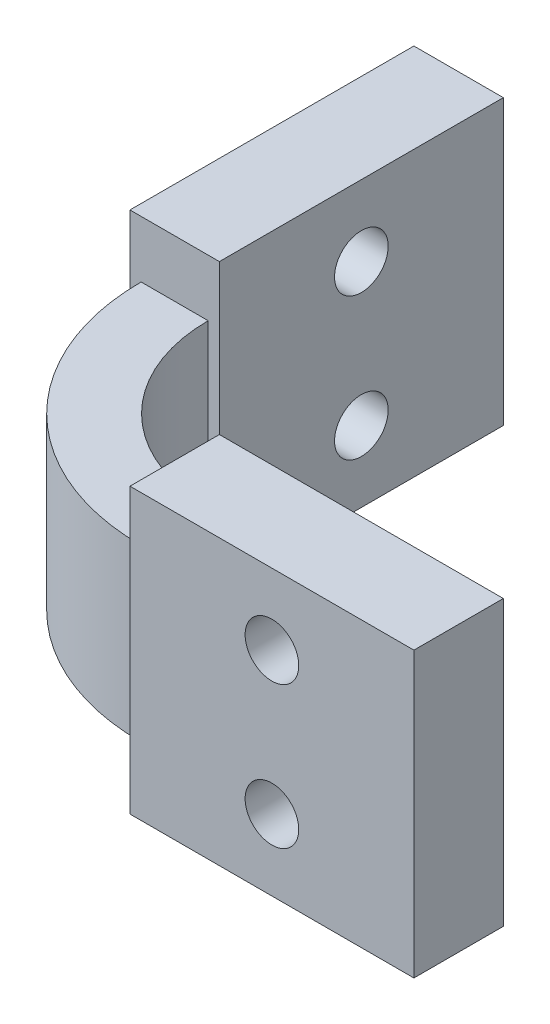
ISO-10303-21;
HEADER;
FILE_DESCRIPTION(('STEP AP214'),'2;1');
FILE_NAME('part.step','',(''),(''),'','','');
FILE_SCHEMA(('AUTOMOTIVE_DESIGN { 1 0 10303 214 1 1 1 1 }'));
ENDSEC;
DATA;
#1=APPLICATION_CONTEXT('core data for automotive mechanical design processes');
#2=APPLICATION_PROTOCOL_DEFINITION('international standard','automotive_design',2000,#1);
#3=PRODUCT_CONTEXT('',#1,'mechanical');
#4=PRODUCT('Part','Part','',(#3));
#5=PRODUCT_RELATED_PRODUCT_CATEGORY('part','',(#4));
#6=PRODUCT_DEFINITION_FORMATION('','',#4);
#7=PRODUCT_DEFINITION_CONTEXT('part definition',#1,'design');
#8=PRODUCT_DEFINITION('design','',#6,#7);
#9=PRODUCT_DEFINITION_SHAPE('','',#8);
#10=(LENGTH_UNIT() NAMED_UNIT(*) SI_UNIT(.MILLI.,.METRE.));
#11=(NAMED_UNIT(*) PLANE_ANGLE_UNIT() SI_UNIT($,.RADIAN.));
#12=(NAMED_UNIT(*) SI_UNIT($,.STERADIAN.) SOLID_ANGLE_UNIT());
#13=UNCERTAINTY_MEASURE_WITH_UNIT(LENGTH_MEASURE(1.E-05),#10,'distance_accuracy_value','');
#14=(GEOMETRIC_REPRESENTATION_CONTEXT(3) GLOBAL_UNCERTAINTY_ASSIGNED_CONTEXT((#13)) GLOBAL_UNIT_ASSIGNED_CONTEXT((#10,
#11,#12)) REPRESENTATION_CONTEXT('',''));
#15=CARTESIAN_POINT('',(0.,0.,0.));
#16=DIRECTION('',(0.,0.,1.));
#17=DIRECTION('',(1.,0.,0.));
#18=AXIS2_PLACEMENT_3D('',#15,#16,#17);
#19=CARTESIAN_POINT('',(6.95399999999999,3.81,-8.16));
#20=DIRECTION('',(0.,1.,0.));
#21=DIRECTION('',(0.,0.,1.));
#22=AXIS2_PLACEMENT_3D('',#19,#20,#21);
#23=PLANE('',#22);
#24=CARTESIAN_POINT('',(6.954,3.81,-8.16));
#25=DIRECTION('',(0.,-1.,0.));
#26=DIRECTION('',(0.,0.,1.));
#27=AXIS2_PLACEMENT_3D('',#24,#25,#26);
#28=CIRCLE('',#27,7.2);
#29=CARTESIAN_POINT('',(6.954,3.81,-0.960000000000003));
#30=VERTEX_POINT('',#29);
#31=CARTESIAN_POINT('',(-0.245999999999999,3.81,-8.16));
#32=VERTEX_POINT('',#31);
#33=EDGE_CURVE('E50',#30,#32,#28,.T.);
#34=ORIENTED_EDGE('',*,*,#33,.T.);
#35=DIRECTION('',(-1.,0.,0.));
#36=VECTOR('',#35,1.);
#37=CARTESIAN_POINT('',(6.95399999999999,3.81,-8.16));
#38=LINE('',#37,#36);
#39=CARTESIAN_POINT('',(-3.24600000000001,3.81,-8.16));
#40=VERTEX_POINT('',#39);
#41=EDGE_CURVE('E165',#32,#40,#38,.T.);
#42=ORIENTED_EDGE('',*,*,#41,.T.);
#43=CARTESIAN_POINT('',(6.95399999999999,3.81,-8.16));
#44=DIRECTION('',(0.,1.,0.));
#45=DIRECTION('',(0.,0.,1.));
#46=AXIS2_PLACEMENT_3D('',#43,#44,#45);
#47=CIRCLE('',#46,10.2);
#48=CARTESIAN_POINT('',(6.954,3.81,2.04));
#49=VERTEX_POINT('',#48);
#50=EDGE_CURVE('E189',#40,#49,#47,.T.);
#51=ORIENTED_EDGE('',*,*,#50,.T.);
#52=DIRECTION('',(0.,0.,1.));
#53=VECTOR('',#52,1.);
#54=CARTESIAN_POINT('',(6.954,3.81,-1.46));
#55=LINE('',#54,#53);
#56=EDGE_CURVE('E55',#30,#49,#55,.T.);
#57=ORIENTED_EDGE('',*,*,#56,.F.);
#58=EDGE_LOOP('',(#34,#42,#51,#57));
#59=FACE_BOUND('',#58,.T.);
#60=ADVANCED_FACE('F35',(#59),#23,.T.);
#61=CARTESIAN_POINT('',(-3.746,3.81,-20.86));
#62=DIRECTION('',(1.,0.,0.));
#63=DIRECTION('',(0.,0.,-1.));
#64=AXIS2_PLACEMENT_3D('',#61,#62,#63);
#65=PLANE('',#64);
#66=CARTESIAN_POINT('',(-3.746,3.175,-14.51));
#67=DIRECTION('',(1.,0.,0.));
#68=DIRECTION('',(0.,0.,-1.));
#69=AXIS2_PLACEMENT_3D('',#66,#67,#68);
#70=CIRCLE('',#69,1.2);
#71=CARTESIAN_POINT('',(-3.746,3.175,-15.71));
#72=VERTEX_POINT('',#71);
#73=EDGE_CURVE('E303',#72,#72,#70,.T.);
#74=ORIENTED_EDGE('',*,*,#73,.T.);
#75=EDGE_LOOP('',(#74));
#76=FACE_BOUND('',#75,.T.);
#77=CARTESIAN_POINT('',(-3.746,-3.175,-14.51));
#78=DIRECTION('',(1.,0.,0.));
#79=DIRECTION('',(0.,0.,-1.));
#80=AXIS2_PLACEMENT_3D('',#77,#78,#79);
#81=CIRCLE('',#80,1.2);
#82=CARTESIAN_POINT('',(-3.746,-3.175,-15.71));
#83=VERTEX_POINT('',#82);
#84=EDGE_CURVE('E143',#83,#83,#81,.T.);
#85=ORIENTED_EDGE('',*,*,#84,.T.);
#86=EDGE_LOOP('',(#85));
#87=FACE_BOUND('',#86,.T.);
#88=DIRECTION('',(0.,-1.,0.));
#89=VECTOR('',#88,1.);
#90=CARTESIAN_POINT('',(-3.746,3.81,-20.86));
#91=LINE('',#90,#89);
#92=CARTESIAN_POINT('',(-3.746,6.35,-20.86));
#93=VERTEX_POINT('',#92);
#94=CARTESIAN_POINT('',(-3.746,-6.35,-20.86));
#95=VERTEX_POINT('',#94);
#96=EDGE_CURVE('E145',#93,#95,#91,.T.);
#97=ORIENTED_EDGE('',*,*,#96,.T.);
#98=DIRECTION('',(0.,0.,1.));
#99=VECTOR('',#98,1.);
#100=CARTESIAN_POINT('',(-3.746,-6.35,-20.86));
#101=LINE('',#100,#99);
#102=CARTESIAN_POINT('',(-3.746,-6.35,-8.16));
#103=VERTEX_POINT('',#102);
#104=EDGE_CURVE('E139',#95,#103,#101,.T.);
#105=ORIENTED_EDGE('',*,*,#104,.T.);
#106=DIRECTION('',(0.,-1.,0.));
#107=VECTOR('',#106,1.);
#108=CARTESIAN_POINT('',(-3.746,3.81,-8.16));
#109=LINE('',#108,#107);
#110=CARTESIAN_POINT('',(-3.746,6.35,-8.16));
#111=VERTEX_POINT('',#110);
#112=EDGE_CURVE('E122',#111,#103,#109,.T.);
#113=ORIENTED_EDGE('',*,*,#112,.F.);
#114=DIRECTION('',(0.,0.,1.));
#115=VECTOR('',#114,1.);
#116=CARTESIAN_POINT('',(-3.746,6.35,-20.86));
#117=LINE('',#116,#115);
#118=EDGE_CURVE('E173',#93,#111,#117,.T.);
#119=ORIENTED_EDGE('',*,*,#118,.F.);
#120=EDGE_LOOP('',(#97,#105,#113,#119));
#121=FACE_BOUND('',#120,.T.);
#122=ADVANCED_FACE('F37',(#76,#87,#121),#65,.F.);
#123=CARTESIAN_POINT('',(6.95399999999999,3.81,-8.16));
#124=DIRECTION('',(0.,-1.,0.));
#125=DIRECTION('',(0.,0.,-1.));
#126=AXIS2_PLACEMENT_3D('',#123,#124,#125);
#127=CYLINDRICAL_SURFACE('',#126,10.2);
#128=CARTESIAN_POINT('',(6.95399999999999,-3.81,-8.16));
#129=DIRECTION('',(0.,1.,0.));
#130=DIRECTION('',(0.,0.,1.));
#131=AXIS2_PLACEMENT_3D('',#128,#129,#130);
#132=CIRCLE('',#131,10.2);
#133=CARTESIAN_POINT('',(-3.24600000000001,-3.81,-8.16));
#134=VERTEX_POINT('',#133);
#135=CARTESIAN_POINT('',(6.954,-3.81,2.04));
#136=VERTEX_POINT('',#135);
#137=EDGE_CURVE('E187',#134,#136,#132,.T.);
#138=ORIENTED_EDGE('',*,*,#137,.T.);
#139=DIRECTION('',(0.,-1.,0.));
#140=VECTOR('',#139,1.);
#141=CARTESIAN_POINT('',(6.954,3.81,2.04));
#142=LINE('',#141,#140);
#143=EDGE_CURVE('E216',#49,#136,#142,.T.);
#144=ORIENTED_EDGE('',*,*,#143,.F.);
#145=ORIENTED_EDGE('',*,*,#50,.F.);
#146=DIRECTION('',(0.,-1.,0.));
#147=VECTOR('',#146,1.);
#148=CARTESIAN_POINT('',(-3.24600000000001,3.81,-8.16));
#149=LINE('',#148,#147);
#150=EDGE_CURVE('E133',#40,#134,#149,.T.);
#151=ORIENTED_EDGE('',*,*,#150,.T.);
#152=EDGE_LOOP('',(#138,#144,#145,#151));
#153=FACE_BOUND('',#152,.T.);
#154=ADVANCED_FACE('F227',(#153),#127,.T.);
#155=CARTESIAN_POINT('',(6.954,3.81,2.54));
#156=DIRECTION('',(0.,0.,-1.));
#157=DIRECTION('',(-1.,0.,0.));
#158=AXIS2_PLACEMENT_3D('',#155,#156,#157);
#159=PLANE('',#158);
#160=CARTESIAN_POINT('',(13.304,3.175,2.54));
#161=DIRECTION('',(0.,0.,-1.));
#162=DIRECTION('',(-1.,0.,0.));
#163=AXIS2_PLACEMENT_3D('',#160,#161,#162);
#164=CIRCLE('',#163,1.19999999999999);
#165=CARTESIAN_POINT('',(12.104,3.175,2.54));
#166=VERTEX_POINT('',#165);
#167=EDGE_CURVE('E286',#166,#166,#164,.T.);
#168=ORIENTED_EDGE('',*,*,#167,.T.);
#169=EDGE_LOOP('',(#168));
#170=FACE_BOUND('',#169,.T.);
#171=CARTESIAN_POINT('',(13.304,-3.175,2.54));
#172=DIRECTION('',(0.,0.,-1.));
#173=DIRECTION('',(-1.,0.,0.));
#174=AXIS2_PLACEMENT_3D('',#171,#172,#173);
#175=CIRCLE('',#174,1.19999999999999);
#176=CARTESIAN_POINT('',(12.104,-3.175,2.54));
#177=VERTEX_POINT('',#176);
#178=EDGE_CURVE('E297',#177,#177,#175,.T.);
#179=ORIENTED_EDGE('',*,*,#178,.T.);
#180=EDGE_LOOP('',(#179));
#181=FACE_BOUND('',#180,.T.);
#182=DIRECTION('',(0.,-1.,0.));
#183=VECTOR('',#182,1.);
#184=CARTESIAN_POINT('',(6.954,3.81,2.54));
#185=LINE('',#184,#183);
#186=CARTESIAN_POINT('',(6.954,6.35,2.54));
#187=VERTEX_POINT('',#186);
#188=CARTESIAN_POINT('',(6.954,-6.35,2.54));
#189=VERTEX_POINT('',#188);
#190=EDGE_CURVE('E214',#187,#189,#185,.T.);
#191=ORIENTED_EDGE('',*,*,#190,.T.);
#192=DIRECTION('',(1.,0.,0.));
#193=VECTOR('',#192,1.);
#194=CARTESIAN_POINT('',(6.954,-6.35,2.54));
#195=LINE('',#194,#193);
#196=CARTESIAN_POINT('',(19.654,-6.35,2.54));
#197=VERTEX_POINT('',#196);
#198=EDGE_CURVE('E161',#189,#197,#195,.T.);
#199=ORIENTED_EDGE('',*,*,#198,.T.);
#200=DIRECTION('',(0.,-1.,0.));
#201=VECTOR('',#200,1.);
#202=CARTESIAN_POINT('',(19.654,3.81,2.54));
#203=LINE('',#202,#201);
#204=CARTESIAN_POINT('',(19.654,6.35,2.54));
#205=VERTEX_POINT('',#204);
#206=EDGE_CURVE('E212',#205,#197,#203,.T.);
#207=ORIENTED_EDGE('',*,*,#206,.F.);
#208=DIRECTION('',(1.,0.,0.));
#209=VECTOR('',#208,1.);
#210=CARTESIAN_POINT('',(6.954,6.35,2.54));
#211=LINE('',#210,#209);
#212=EDGE_CURVE('E178',#187,#205,#211,.T.);
#213=ORIENTED_EDGE('',*,*,#212,.F.);
#214=EDGE_LOOP('',(#191,#199,#207,#213));
#215=FACE_BOUND('',#214,.T.);
#216=ADVANCED_FACE('F336',(#170,#181,#215),#159,.F.);
#217=CARTESIAN_POINT('',(19.654,3.81,-1.46));
#218=DIRECTION('',(-1.,0.,0.));
#219=DIRECTION('',(0.,0.,1.));
#220=AXIS2_PLACEMENT_3D('',#217,#218,#219);
#221=PLANE('',#220);
#222=ORIENTED_EDGE('',*,*,#206,.T.);
#223=DIRECTION('',(0.,0.,-1.));
#224=VECTOR('',#223,1.);
#225=CARTESIAN_POINT('',(19.654,-6.35,2.54));
#226=LINE('',#225,#224);
#227=CARTESIAN_POINT('',(19.654,-6.35,-1.46));
#228=VERTEX_POINT('',#227);
#229=EDGE_CURVE('E158',#197,#228,#226,.T.);
#230=ORIENTED_EDGE('',*,*,#229,.T.);
#231=DIRECTION('',(0.,-1.,0.));
#232=VECTOR('',#231,1.);
#233=CARTESIAN_POINT('',(19.654,3.81,-1.46));
#234=LINE('',#233,#232);
#235=CARTESIAN_POINT('',(19.654,6.35,-1.46));
#236=VERTEX_POINT('',#235);
#237=EDGE_CURVE('E210',#236,#228,#234,.T.);
#238=ORIENTED_EDGE('',*,*,#237,.F.);
#239=DIRECTION('',(0.,0.,-1.));
#240=VECTOR('',#239,1.);
#241=CARTESIAN_POINT('',(19.654,6.35,2.54));
#242=LINE('',#241,#240);
#243=EDGE_CURVE('E181',#205,#236,#242,.T.);
#244=ORIENTED_EDGE('',*,*,#243,.F.);
#245=EDGE_LOOP('',(#222,#230,#238,#244));
#246=FACE_BOUND('',#245,.T.);
#247=ADVANCED_FACE('F333',(#246),#221,.F.);
#248=CARTESIAN_POINT('',(6.954,3.81,-1.46));
#249=DIRECTION('',(0.,0.,1.));
#250=DIRECTION('',(1.,0.,0.));
#251=AXIS2_PLACEMENT_3D('',#248,#249,#250);
#252=PLANE('',#251);
#253=CARTESIAN_POINT('',(13.304,3.175,-1.46));
#254=DIRECTION('',(0.,0.,-1.));
#255=DIRECTION('',(-1.,0.,0.));
#256=AXIS2_PLACEMENT_3D('',#253,#254,#255);
#257=CIRCLE('',#256,1.19999999999999);
#258=CARTESIAN_POINT('',(12.104,3.175,-1.46));
#259=VERTEX_POINT('',#258);
#260=EDGE_CURVE('E289',#259,#259,#257,.T.);
#261=ORIENTED_EDGE('',*,*,#260,.F.);
#262=EDGE_LOOP('',(#261));
#263=FACE_BOUND('',#262,.T.);
#264=CARTESIAN_POINT('',(13.304,-3.175,-1.46));
#265=DIRECTION('',(0.,0.,-1.));
#266=DIRECTION('',(-1.,0.,0.));
#267=AXIS2_PLACEMENT_3D('',#264,#265,#266);
#268=CIRCLE('',#267,1.19999999999999);
#269=CARTESIAN_POINT('',(12.104,-3.175,-1.46));
#270=VERTEX_POINT('',#269);
#271=EDGE_CURVE('E292',#270,#270,#268,.T.);
#272=ORIENTED_EDGE('',*,*,#271,.F.);
#273=EDGE_LOOP('',(#272));
#274=FACE_BOUND('',#273,.T.);
#275=ORIENTED_EDGE('',*,*,#237,.T.);
#276=DIRECTION('',(-1.,0.,0.));
#277=VECTOR('',#276,1.);
#278=CARTESIAN_POINT('',(19.654,-6.35,-1.46));
#279=LINE('',#278,#277);
#280=CARTESIAN_POINT('',(6.954,-6.35,-1.46));
#281=VERTEX_POINT('',#280);
#282=EDGE_CURVE('E155',#228,#281,#279,.T.);
#283=ORIENTED_EDGE('',*,*,#282,.T.);
#284=DIRECTION('',(0.,-1.,0.));
#285=VECTOR('',#284,1.);
#286=CARTESIAN_POINT('',(6.954,3.81,-1.46));
#287=LINE('',#286,#285);
#288=CARTESIAN_POINT('',(6.954,6.35,-1.46));
#289=VERTEX_POINT('',#288);
#290=EDGE_CURVE('E208',#289,#281,#287,.T.);
#291=ORIENTED_EDGE('',*,*,#290,.F.);
#292=DIRECTION('',(-1.,0.,0.));
#293=VECTOR('',#292,1.);
#294=CARTESIAN_POINT('',(19.654,6.35,-1.46));
#295=LINE('',#294,#293);
#296=EDGE_CURVE('E184',#236,#289,#295,.T.);
#297=ORIENTED_EDGE('',*,*,#296,.F.);
#298=EDGE_LOOP('',(#275,#283,#291,#297));
#299=FACE_BOUND('',#298,.T.);
#300=ADVANCED_FACE('F330',(#263,#274,#299),#252,.F.);
#301=CARTESIAN_POINT('',(6.954,3.81,-1.46));
#302=DIRECTION('',(1.,0.,0.));
#303=DIRECTION('',(0.,0.,-1.));
#304=AXIS2_PLACEMENT_3D('',#301,#302,#303);
#305=PLANE('',#304);
#306=DIRECTION('',(0.,0.,1.));
#307=VECTOR('',#306,1.);
#308=CARTESIAN_POINT('',(6.954,-3.81,-1.46));
#309=LINE('',#308,#307);
#310=CARTESIAN_POINT('',(6.954,-3.81,-0.960000000000003));
#311=VERTEX_POINT('',#310);
#312=EDGE_CURVE('E43',#311,#136,#309,.T.);
#313=ORIENTED_EDGE('',*,*,#312,.F.);
#314=DIRECTION('',(0.,-1.,0.));
#315=VECTOR('',#314,1.);
#316=CARTESIAN_POINT('',(6.954,3.81,-0.960000000000003));
#317=LINE('',#316,#315);
#318=EDGE_CURVE('E205',#30,#311,#317,.T.);
#319=ORIENTED_EDGE('',*,*,#318,.F.);
#320=ORIENTED_EDGE('',*,*,#56,.T.);
#321=ORIENTED_EDGE('',*,*,#143,.T.);
#322=EDGE_LOOP('',(#313,#319,#320,#321));
#323=FACE_BOUND('',#322,.T.);
#324=ORIENTED_EDGE('',*,*,#290,.T.);
#325=DIRECTION('',(0.,0.,1.));
#326=VECTOR('',#325,1.);
#327=CARTESIAN_POINT('',(6.954,-6.35,-1.46));
#328=LINE('',#327,#326);
#329=EDGE_CURVE('E152',#281,#189,#328,.T.);
#330=ORIENTED_EDGE('',*,*,#329,.T.);
#331=ORIENTED_EDGE('',*,*,#190,.F.);
#332=DIRECTION('',(0.,0.,1.));
#333=VECTOR('',#332,1.);
#334=CARTESIAN_POINT('',(6.954,6.35,-1.46));
#335=LINE('',#334,#333);
#336=EDGE_CURVE('E175',#289,#187,#335,.T.);
#337=ORIENTED_EDGE('',*,*,#336,.F.);
#338=EDGE_LOOP('',(#324,#330,#331,#337));
#339=FACE_BOUND('',#338,.T.);
#340=ADVANCED_FACE('F229',(#323,#339),#305,.F.);
#341=CARTESIAN_POINT('',(6.954,3.81,-8.16));
#342=DIRECTION('',(0.,-1.,0.));
#343=DIRECTION('',(0.,0.,-1.));
#344=AXIS2_PLACEMENT_3D('',#341,#342,#343);
#345=CYLINDRICAL_SURFACE('',#344,7.2);
#346=CARTESIAN_POINT('',(6.954,-3.81,-8.16));
#347=DIRECTION('',(0.,-1.,0.));
#348=DIRECTION('',(0.,0.,1.));
#349=AXIS2_PLACEMENT_3D('',#346,#347,#348);
#350=CIRCLE('',#349,7.2);
#351=CARTESIAN_POINT('',(-0.245999999999998,-3.81,-8.16));
#352=VERTEX_POINT('',#351);
#353=EDGE_CURVE('E191',#311,#352,#350,.T.);
#354=ORIENTED_EDGE('',*,*,#353,.T.);
#355=DIRECTION('',(0.,-1.,0.));
#356=VECTOR('',#355,1.);
#357=CARTESIAN_POINT('',(-0.245999999999999,3.81,-8.16));
#358=LINE('',#357,#356);
#359=EDGE_CURVE('E202',#32,#352,#358,.T.);
#360=ORIENTED_EDGE('',*,*,#359,.F.);
#361=ORIENTED_EDGE('',*,*,#33,.F.);
#362=ORIENTED_EDGE('',*,*,#318,.T.);
#363=EDGE_LOOP('',(#354,#360,#361,#362));
#364=FACE_BOUND('',#363,.T.);
#365=ADVANCED_FACE('F233',(#364),#345,.F.);
#366=CARTESIAN_POINT('',(-0.245999999999999,3.81,-8.16));
#367=DIRECTION('',(0.,0.,-1.));
#368=DIRECTION('',(-1.,0.,0.));
#369=AXIS2_PLACEMENT_3D('',#366,#367,#368);
#370=PLANE('',#369);
#371=DIRECTION('',(1.,0.,0.));
#372=VECTOR('',#371,1.);
#373=CARTESIAN_POINT('',(6.95399999999999,-3.81,-8.16));
#374=LINE('',#373,#372);
#375=EDGE_CURVE('E11',#134,#352,#374,.T.);
#376=ORIENTED_EDGE('',*,*,#375,.F.);
#377=ORIENTED_EDGE('',*,*,#150,.F.);
#378=ORIENTED_EDGE('',*,*,#41,.F.);
#379=ORIENTED_EDGE('',*,*,#359,.T.);
#380=EDGE_LOOP('',(#376,#377,#378,#379));
#381=FACE_BOUND('',#380,.T.);
#382=ORIENTED_EDGE('',*,*,#112,.T.);
#383=DIRECTION('',(1.,0.,0.));
#384=VECTOR('',#383,1.);
#385=CARTESIAN_POINT('',(-3.746,-6.35,-8.16));
#386=LINE('',#385,#384);
#387=CARTESIAN_POINT('',(0.253999999999996,-6.35,-8.16));
#388=VERTEX_POINT('',#387);
#389=EDGE_CURVE('E125',#103,#388,#386,.T.);
#390=ORIENTED_EDGE('',*,*,#389,.T.);
#391=DIRECTION('',(0.,-1.,0.));
#392=VECTOR('',#391,1.);
#393=CARTESIAN_POINT('',(0.253999999999996,3.81,-8.16));
#394=LINE('',#393,#392);
#395=CARTESIAN_POINT('',(0.253999999999996,6.35,-8.16));
#396=VERTEX_POINT('',#395);
#397=EDGE_CURVE('E200',#396,#388,#394,.T.);
#398=ORIENTED_EDGE('',*,*,#397,.F.);
#399=DIRECTION('',(1.,0.,0.));
#400=VECTOR('',#399,1.);
#401=CARTESIAN_POINT('',(-3.746,6.35,-8.16));
#402=LINE('',#401,#400);
#403=EDGE_CURVE('E128',#111,#396,#402,.T.);
#404=ORIENTED_EDGE('',*,*,#403,.F.);
#405=EDGE_LOOP('',(#382,#390,#398,#404));
#406=FACE_BOUND('',#405,.T.);
#407=ADVANCED_FACE('F124',(#381,#406),#370,.F.);
#408=CARTESIAN_POINT('',(0.253999999999997,3.81,-20.86));
#409=DIRECTION('',(-1.,0.,0.));
#410=DIRECTION('',(0.,0.,1.));
#411=AXIS2_PLACEMENT_3D('',#408,#409,#410);
#412=PLANE('',#411);
#413=CARTESIAN_POINT('',(0.253999999999998,3.175,-14.51));
#414=DIRECTION('',(1.,0.,0.));
#415=DIRECTION('',(0.,0.,-1.));
#416=AXIS2_PLACEMENT_3D('',#413,#414,#415);
#417=CIRCLE('',#416,1.19999999999999);
#418=CARTESIAN_POINT('',(0.253999999999998,3.175,-15.71));
#419=VERTEX_POINT('',#418);
#420=EDGE_CURVE('E300',#419,#419,#417,.T.);
#421=ORIENTED_EDGE('',*,*,#420,.F.);
#422=EDGE_LOOP('',(#421));
#423=FACE_BOUND('',#422,.T.);
#424=CARTESIAN_POINT('',(0.253999999999998,-3.175,-14.51));
#425=DIRECTION('',(1.,0.,0.));
#426=DIRECTION('',(0.,0.,-1.));
#427=AXIS2_PLACEMENT_3D('',#424,#425,#426);
#428=CIRCLE('',#427,1.19999999999999);
#429=CARTESIAN_POINT('',(0.253999999999998,-3.175,-15.71));
#430=VERTEX_POINT('',#429);
#431=EDGE_CURVE('E306',#430,#430,#428,.T.);
#432=ORIENTED_EDGE('',*,*,#431,.F.);
#433=EDGE_LOOP('',(#432));
#434=FACE_BOUND('',#433,.T.);
#435=ORIENTED_EDGE('',*,*,#397,.T.);
#436=DIRECTION('',(0.,0.,-1.));
#437=VECTOR('',#436,1.);
#438=CARTESIAN_POINT('',(0.253999999999996,-6.35,-8.16));
#439=LINE('',#438,#437);
#440=CARTESIAN_POINT('',(0.253999999999997,-6.35,-20.86));
#441=VERTEX_POINT('',#440);
#442=EDGE_CURVE('E142',#388,#441,#439,.T.);
#443=ORIENTED_EDGE('',*,*,#442,.T.);
#444=DIRECTION('',(0.,-1.,0.));
#445=VECTOR('',#444,1.);
#446=CARTESIAN_POINT('',(0.253999999999997,3.81,-20.86));
#447=LINE('',#446,#445);
#448=CARTESIAN_POINT('',(0.253999999999997,6.35,-20.86));
#449=VERTEX_POINT('',#448);
#450=EDGE_CURVE('E198',#449,#441,#447,.T.);
#451=ORIENTED_EDGE('',*,*,#450,.F.);
#452=DIRECTION('',(0.,0.,-1.));
#453=VECTOR('',#452,1.);
#454=CARTESIAN_POINT('',(0.253999999999996,6.35,-8.16));
#455=LINE('',#454,#453);
#456=EDGE_CURVE('E167',#396,#449,#455,.T.);
#457=ORIENTED_EDGE('',*,*,#456,.F.);
#458=EDGE_LOOP('',(#435,#443,#451,#457));
#459=FACE_BOUND('',#458,.T.);
#460=ADVANCED_FACE('F247',(#423,#434,#459),#412,.F.);
#461=CARTESIAN_POINT('',(-3.746,3.81,-20.86));
#462=DIRECTION('',(0.,0.,1.));
#463=DIRECTION('',(1.,0.,0.));
#464=AXIS2_PLACEMENT_3D('',#461,#462,#463);
#465=PLANE('',#464);
#466=ORIENTED_EDGE('',*,*,#450,.T.);
#467=DIRECTION('',(-1.,0.,0.));
#468=VECTOR('',#467,1.);
#469=CARTESIAN_POINT('',(0.253999999999997,-6.35,-20.86));
#470=LINE('',#469,#468);
#471=EDGE_CURVE('E146',#441,#95,#470,.T.);
#472=ORIENTED_EDGE('',*,*,#471,.T.);
#473=ORIENTED_EDGE('',*,*,#96,.F.);
#474=DIRECTION('',(-1.,0.,0.));
#475=VECTOR('',#474,1.);
#476=CARTESIAN_POINT('',(0.253999999999997,6.35,-20.86));
#477=LINE('',#476,#475);
#478=EDGE_CURVE('E170',#449,#93,#477,.T.);
#479=ORIENTED_EDGE('',*,*,#478,.F.);
#480=EDGE_LOOP('',(#466,#472,#473,#479));
#481=FACE_BOUND('',#480,.T.);
#482=ADVANCED_FACE('F238',(#481),#465,.F.);
#483=CARTESIAN_POINT('',(6.95399999999999,-3.81,-8.16));
#484=DIRECTION('',(0.,1.,0.));
#485=DIRECTION('',(0.,0.,1.));
#486=AXIS2_PLACEMENT_3D('',#483,#484,#485);
#487=PLANE('',#486);
#488=ORIENTED_EDGE('',*,*,#137,.F.);
#489=ORIENTED_EDGE('',*,*,#375,.T.);
#490=ORIENTED_EDGE('',*,*,#353,.F.);
#491=ORIENTED_EDGE('',*,*,#312,.T.);
#492=EDGE_LOOP('',(#488,#489,#490,#491));
#493=FACE_BOUND('',#492,.T.);
#494=ADVANCED_FACE('F235',(#493),#487,.F.);
#495=CARTESIAN_POINT('',(0.,6.35,0.));
#496=DIRECTION('',(0.,1.,0.));
#497=DIRECTION('',(0.,0.,1.));
#498=AXIS2_PLACEMENT_3D('',#495,#496,#497);
#499=PLANE('',#498);
#500=ORIENTED_EDGE('',*,*,#336,.T.);
#501=ORIENTED_EDGE('',*,*,#212,.T.);
#502=ORIENTED_EDGE('',*,*,#243,.T.);
#503=ORIENTED_EDGE('',*,*,#296,.T.);
#504=EDGE_LOOP('',(#500,#501,#502,#503));
#505=FACE_BOUND('',#504,.T.);
#506=ADVANCED_FACE('F237',(#505),#499,.T.);
#507=CARTESIAN_POINT('',(0.,6.35,0.));
#508=DIRECTION('',(0.,1.,0.));
#509=DIRECTION('',(0.,0.,1.));
#510=AXIS2_PLACEMENT_3D('',#507,#508,#509);
#511=PLANE('',#510);
#512=ORIENTED_EDGE('',*,*,#403,.T.);
#513=ORIENTED_EDGE('',*,*,#456,.T.);
#514=ORIENTED_EDGE('',*,*,#478,.T.);
#515=ORIENTED_EDGE('',*,*,#118,.T.);
#516=EDGE_LOOP('',(#512,#513,#514,#515));
#517=FACE_BOUND('',#516,.T.);
#518=ADVANCED_FACE('F244',(#517),#511,.T.);
#519=CARTESIAN_POINT('',(0.,-6.35,0.));
#520=DIRECTION('',(0.,-1.,0.));
#521=DIRECTION('',(0.,0.,1.));
#522=AXIS2_PLACEMENT_3D('',#519,#520,#521);
#523=PLANE('',#522);
#524=ORIENTED_EDGE('',*,*,#329,.F.);
#525=ORIENTED_EDGE('',*,*,#282,.F.);
#526=ORIENTED_EDGE('',*,*,#229,.F.);
#527=ORIENTED_EDGE('',*,*,#198,.F.);
#528=EDGE_LOOP('',(#524,#525,#526,#527));
#529=FACE_BOUND('',#528,.T.);
#530=ADVANCED_FACE('F259',(#529),#523,.T.);
#531=CARTESIAN_POINT('',(0.,-6.35,0.));
#532=DIRECTION('',(0.,-1.,0.));
#533=DIRECTION('',(0.,0.,1.));
#534=AXIS2_PLACEMENT_3D('',#531,#532,#533);
#535=PLANE('',#534);
#536=ORIENTED_EDGE('',*,*,#389,.F.);
#537=ORIENTED_EDGE('',*,*,#104,.F.);
#538=ORIENTED_EDGE('',*,*,#471,.F.);
#539=ORIENTED_EDGE('',*,*,#442,.F.);
#540=EDGE_LOOP('',(#536,#537,#538,#539));
#541=FACE_BOUND('',#540,.T.);
#542=ADVANCED_FACE('F137',(#541),#535,.T.);
#543=CARTESIAN_POINT('',(0.253999999999996,-3.175,-14.51));
#544=DIRECTION('',(1.,0.,0.));
#545=DIRECTION('',(0.,0.,-1.));
#546=AXIS2_PLACEMENT_3D('',#543,#544,#545);
#547=CYLINDRICAL_SURFACE('',#546,1.19999999999999);
#548=ORIENTED_EDGE('',*,*,#84,.F.);
#549=EDGE_LOOP('',(#548));
#550=FACE_BOUND('',#549,.T.);
#551=ORIENTED_EDGE('',*,*,#431,.T.);
#552=EDGE_LOOP('',(#551));
#553=FACE_BOUND('',#552,.T.);
#554=ADVANCED_FACE('F266',(#550,#553),#547,.F.);
#555=CARTESIAN_POINT('',(0.253999999999996,3.175,-14.51));
#556=DIRECTION('',(1.,0.,0.));
#557=DIRECTION('',(0.,0.,-1.));
#558=AXIS2_PLACEMENT_3D('',#555,#556,#557);
#559=CYLINDRICAL_SURFACE('',#558,1.19999999999999);
#560=ORIENTED_EDGE('',*,*,#73,.F.);
#561=EDGE_LOOP('',(#560));
#562=FACE_BOUND('',#561,.T.);
#563=ORIENTED_EDGE('',*,*,#420,.T.);
#564=EDGE_LOOP('',(#563));
#565=FACE_BOUND('',#564,.T.);
#566=ADVANCED_FACE('F269',(#562,#565),#559,.F.);
#567=CARTESIAN_POINT('',(13.304,-3.175,-1.46));
#568=DIRECTION('',(0.,0.,-1.));
#569=DIRECTION('',(-1.,0.,0.));
#570=AXIS2_PLACEMENT_3D('',#567,#568,#569);
#571=CYLINDRICAL_SURFACE('',#570,1.19999999999999);
#572=ORIENTED_EDGE('',*,*,#178,.F.);
#573=EDGE_LOOP('',(#572));
#574=FACE_BOUND('',#573,.T.);
#575=ORIENTED_EDGE('',*,*,#271,.T.);
#576=EDGE_LOOP('',(#575));
#577=FACE_BOUND('',#576,.T.);
#578=ADVANCED_FACE('F273',(#574,#577),#571,.F.);
#579=CARTESIAN_POINT('',(13.304,3.175,-1.46));
#580=DIRECTION('',(0.,0.,-1.));
#581=DIRECTION('',(-1.,0.,0.));
#582=AXIS2_PLACEMENT_3D('',#579,#580,#581);
#583=CYLINDRICAL_SURFACE('',#582,1.19999999999999);
#584=ORIENTED_EDGE('',*,*,#167,.F.);
#585=EDGE_LOOP('',(#584));
#586=FACE_BOUND('',#585,.T.);
#587=ORIENTED_EDGE('',*,*,#260,.T.);
#588=EDGE_LOOP('',(#587));
#589=FACE_BOUND('',#588,.T.);
#590=ADVANCED_FACE('F277',(#586,#589),#583,.F.);
#591=CLOSED_SHELL('',(#60,#122,#154,#216,#247,#300,#340,#365,#407,#460,#482,#494,#506,#518,#530,
#542,#554,#566,#578,#590));
#592=MANIFOLD_SOLID_BREP('B2',#591);
#593=ADVANCED_BREP_SHAPE_REPRESENTATION('',(#18,#592),#14);
#594=SHAPE_DEFINITION_REPRESENTATION(#9,#593);
ENDSEC;
END-ISO-10303-21;
